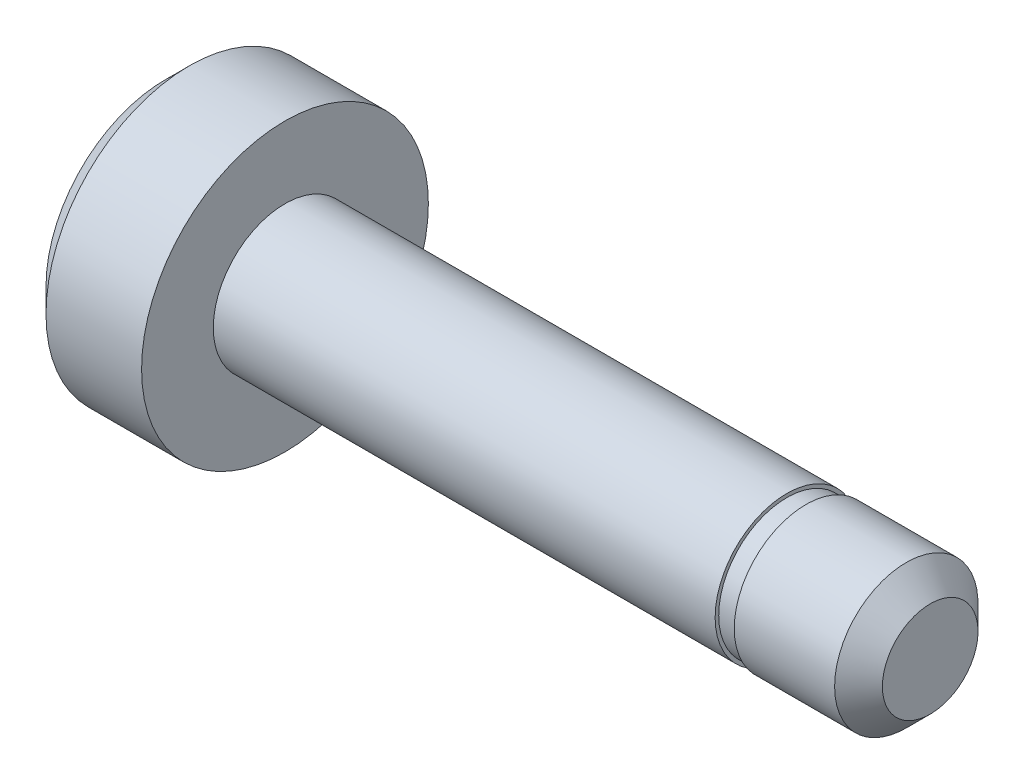
ISO-10303-21;
HEADER;
FILE_DESCRIPTION(('STEP AP214'),'2;1');
FILE_NAME('part.step','',(''),(''),'','','');
FILE_SCHEMA(('AUTOMOTIVE_DESIGN { 1 0 10303 214 1 1 1 1 }'));
ENDSEC;
DATA;
#1=APPLICATION_CONTEXT('core data for automotive mechanical design processes');
#2=APPLICATION_PROTOCOL_DEFINITION('international standard','automotive_design',2000,#1);
#3=PRODUCT_CONTEXT('',#1,'mechanical');
#4=PRODUCT('Part','Part','',(#3));
#5=PRODUCT_RELATED_PRODUCT_CATEGORY('part','',(#4));
#6=PRODUCT_DEFINITION_FORMATION('','',#4);
#7=PRODUCT_DEFINITION_CONTEXT('part definition',#1,'design');
#8=PRODUCT_DEFINITION('design','',#6,#7);
#9=PRODUCT_DEFINITION_SHAPE('','',#8);
#10=(LENGTH_UNIT() NAMED_UNIT(*) SI_UNIT(.MILLI.,.METRE.));
#11=(NAMED_UNIT(*) PLANE_ANGLE_UNIT() SI_UNIT($,.RADIAN.));
#12=(NAMED_UNIT(*) SI_UNIT($,.STERADIAN.) SOLID_ANGLE_UNIT());
#13=UNCERTAINTY_MEASURE_WITH_UNIT(LENGTH_MEASURE(1.E-05),#10,'distance_accuracy_value','');
#14=(GEOMETRIC_REPRESENTATION_CONTEXT(3) GLOBAL_UNCERTAINTY_ASSIGNED_CONTEXT((#13)) GLOBAL_UNIT_ASSIGNED_CONTEXT((#10,
#11,#12)) REPRESENTATION_CONTEXT('',''));
#15=CARTESIAN_POINT('',(0.,0.,0.));
#16=DIRECTION('',(0.,0.,1.));
#17=DIRECTION('',(1.,0.,0.));
#18=AXIS2_PLACEMENT_3D('',#15,#16,#17);
#19=CARTESIAN_POINT('',(-27.0938896189225,0.,0.));
#20=DIRECTION('',(-1.,0.,0.));
#21=DIRECTION('',(0.,0.,1.));
#22=AXIS2_PLACEMENT_3D('',#19,#20,#21);
#23=CYLINDRICAL_SURFACE('',#22,3.);
#24=CARTESIAN_POINT('',(0.,0.,0.));
#25=DIRECTION('',(-1.,0.,0.));
#26=DIRECTION('',(0.,0.,1.));
#27=AXIS2_PLACEMENT_3D('',#24,#25,#26);
#28=CIRCLE('',#27,3.);
#29=CARTESIAN_POINT('',(0.,0.,3.));
#30=VERTEX_POINT('',#29);
#31=EDGE_CURVE('E10',#30,#30,#28,.T.);
#32=ORIENTED_EDGE('',*,*,#31,.F.);
#33=EDGE_LOOP('',(#32));
#34=FACE_BOUND('',#33,.T.);
#35=CARTESIAN_POINT('',(21.,0.,0.));
#36=DIRECTION('',(-1.,0.,0.));
#37=DIRECTION('',(0.,0.,1.));
#38=AXIS2_PLACEMENT_3D('',#35,#36,#37);
#39=CIRCLE('',#38,3.);
#40=CARTESIAN_POINT('',(21.,0.,3.));
#41=VERTEX_POINT('',#40);
#42=EDGE_CURVE('E65',#41,#41,#39,.T.);
#43=ORIENTED_EDGE('',*,*,#42,.T.);
#44=EDGE_LOOP('',(#43));
#45=FACE_BOUND('',#44,.T.);
#46=ADVANCED_FACE('F31',(#34,#45),#23,.T.);
#47=CARTESIAN_POINT('',(0.,3.,0.));
#48=DIRECTION('',(-1.,0.,0.));
#49=DIRECTION('',(0.,0.,1.));
#50=AXIS2_PLACEMENT_3D('',#47,#48,#49);
#51=PLANE('',#50);
#52=CARTESIAN_POINT('',(0.,0.,0.));
#53=DIRECTION('',(-1.,0.,0.));
#54=DIRECTION('',(0.,0.,1.));
#55=AXIS2_PLACEMENT_3D('',#52,#53,#54);
#56=CIRCLE('',#55,6.);
#57=CARTESIAN_POINT('',(0.,0.,6.));
#58=VERTEX_POINT('',#57);
#59=EDGE_CURVE('E37',#58,#58,#56,.T.);
#60=ORIENTED_EDGE('',*,*,#59,.F.);
#61=EDGE_LOOP('',(#60));
#62=FACE_BOUND('',#61,.T.);
#63=ORIENTED_EDGE('',*,*,#31,.T.);
#64=EDGE_LOOP('',(#63));
#65=FACE_BOUND('',#64,.T.);
#66=ADVANCED_FACE('F111',(#62,#65),#51,.F.);
#67=CARTESIAN_POINT('',(-27.0938896189225,0.,0.));
#68=DIRECTION('',(-1.,0.,0.));
#69=DIRECTION('',(0.,0.,1.));
#70=AXIS2_PLACEMENT_3D('',#67,#68,#69);
#71=CYLINDRICAL_SURFACE('',#70,6.);
#72=CARTESIAN_POINT('',(-4.,0.,0.));
#73=DIRECTION('',(-1.,0.,0.));
#74=DIRECTION('',(0.,0.,1.));
#75=AXIS2_PLACEMENT_3D('',#72,#73,#74);
#76=CIRCLE('',#75,6.);
#77=CARTESIAN_POINT('',(-4.,0.,6.));
#78=VERTEX_POINT('',#77);
#79=EDGE_CURVE('E41',#78,#78,#76,.T.);
#80=ORIENTED_EDGE('',*,*,#79,.F.);
#81=EDGE_LOOP('',(#80));
#82=FACE_BOUND('',#81,.T.);
#83=ORIENTED_EDGE('',*,*,#59,.T.);
#84=EDGE_LOOP('',(#83));
#85=FACE_BOUND('',#84,.T.);
#86=ADVANCED_FACE('F116',(#82,#85),#71,.T.);
#87=CARTESIAN_POINT('',(-4.,0.,0.));
#88=DIRECTION('',(1.,0.,0.));
#89=DIRECTION('',(0.,0.,-1.));
#90=AXIS2_PLACEMENT_3D('',#87,#88,#89);
#91=CONICAL_SURFACE('',#90,6.,0.785398163397448);
#92=CARTESIAN_POINT('',(-5.,0.,0.));
#93=DIRECTION('',(-1.,0.,0.));
#94=DIRECTION('',(0.,0.,1.));
#95=AXIS2_PLACEMENT_3D('',#92,#93,#94);
#96=CIRCLE('',#95,5.);
#97=CARTESIAN_POINT('',(-5.,0.,5.));
#98=VERTEX_POINT('',#97);
#99=EDGE_CURVE('E45',#98,#98,#96,.T.);
#100=ORIENTED_EDGE('',*,*,#99,.F.);
#101=EDGE_LOOP('',(#100));
#102=FACE_BOUND('',#101,.T.);
#103=ORIENTED_EDGE('',*,*,#79,.T.);
#104=EDGE_LOOP('',(#103));
#105=FACE_BOUND('',#104,.T.);
#106=ADVANCED_FACE('F107',(#102,#105),#91,.T.);
#107=CARTESIAN_POINT('',(-5.,5.,0.));
#108=DIRECTION('',(1.,0.,0.));
#109=DIRECTION('',(0.,0.,-1.));
#110=AXIS2_PLACEMENT_3D('',#107,#108,#109);
#111=PLANE('',#110);
#112=ORIENTED_EDGE('',*,*,#99,.T.);
#113=EDGE_LOOP('',(#112));
#114=FACE_BOUND('',#113,.T.);
#115=ADVANCED_FACE('F102',(#114),#111,.F.);
#116=CARTESIAN_POINT('',(27.,2.,0.));
#117=DIRECTION('',(-1.,0.,0.));
#118=DIRECTION('',(0.,0.,1.));
#119=AXIS2_PLACEMENT_3D('',#116,#117,#118);
#120=PLANE('',#119);
#121=CARTESIAN_POINT('',(27.,0.,0.));
#122=DIRECTION('',(-1.,0.,0.));
#123=DIRECTION('',(0.,0.,1.));
#124=AXIS2_PLACEMENT_3D('',#121,#122,#123);
#125=CIRCLE('',#124,2.);
#126=CARTESIAN_POINT('',(27.,0.,2.));
#127=VERTEX_POINT('',#126);
#128=EDGE_CURVE('E50',#127,#127,#125,.T.);
#129=ORIENTED_EDGE('',*,*,#128,.F.);
#130=EDGE_LOOP('',(#129));
#131=FACE_BOUND('',#130,.T.);
#132=ADVANCED_FACE('F97',(#131),#120,.F.);
#133=CARTESIAN_POINT('',(27.,0.,0.));
#134=DIRECTION('',(-1.,0.,0.));
#135=DIRECTION('',(0.,0.,1.));
#136=AXIS2_PLACEMENT_3D('',#133,#134,#135);
#137=CONICAL_SURFACE('',#136,2.,0.785398163397448);
#138=CARTESIAN_POINT('',(26.,0.,0.));
#139=DIRECTION('',(-1.,0.,0.));
#140=DIRECTION('',(0.,0.,1.));
#141=AXIS2_PLACEMENT_3D('',#138,#139,#140);
#142=CIRCLE('',#141,3.);
#143=CARTESIAN_POINT('',(26.,0.,3.));
#144=VERTEX_POINT('',#143);
#145=EDGE_CURVE('E53',#144,#144,#142,.T.);
#146=ORIENTED_EDGE('',*,*,#145,.F.);
#147=EDGE_LOOP('',(#146));
#148=FACE_BOUND('',#147,.T.);
#149=ORIENTED_EDGE('',*,*,#128,.T.);
#150=EDGE_LOOP('',(#149));
#151=FACE_BOUND('',#150,.T.);
#152=ADVANCED_FACE('F91',(#148,#151),#137,.T.);
#153=CARTESIAN_POINT('',(-27.0938896189225,0.,0.));
#154=DIRECTION('',(-1.,0.,0.));
#155=DIRECTION('',(0.,0.,1.));
#156=AXIS2_PLACEMENT_3D('',#153,#154,#155);
#157=CYLINDRICAL_SURFACE('',#156,3.);
#158=CARTESIAN_POINT('',(21.8,0.,0.));
#159=DIRECTION('',(-1.,0.,0.));
#160=DIRECTION('',(0.,0.,1.));
#161=AXIS2_PLACEMENT_3D('',#158,#159,#160);
#162=CIRCLE('',#161,3.);
#163=CARTESIAN_POINT('',(21.8,0.,3.));
#164=VERTEX_POINT('',#163);
#165=EDGE_CURVE('E56',#164,#164,#162,.T.);
#166=ORIENTED_EDGE('',*,*,#165,.F.);
#167=EDGE_LOOP('',(#166));
#168=FACE_BOUND('',#167,.T.);
#169=ORIENTED_EDGE('',*,*,#145,.T.);
#170=EDGE_LOOP('',(#169));
#171=FACE_BOUND('',#170,.T.);
#172=ADVANCED_FACE('F85',(#168,#171),#157,.T.);
#173=CARTESIAN_POINT('',(21.8,3.,0.));
#174=DIRECTION('',(1.,0.,0.));
#175=DIRECTION('',(0.,0.,-1.));
#176=AXIS2_PLACEMENT_3D('',#173,#174,#175);
#177=PLANE('',#176);
#178=CARTESIAN_POINT('',(21.8,0.,0.));
#179=DIRECTION('',(-1.,0.,0.));
#180=DIRECTION('',(0.,0.,1.));
#181=AXIS2_PLACEMENT_3D('',#178,#179,#180);
#182=CIRCLE('',#181,2.85);
#183=CARTESIAN_POINT('',(21.8,0.,2.85));
#184=VERTEX_POINT('',#183);
#185=EDGE_CURVE('E59',#184,#184,#182,.T.);
#186=ORIENTED_EDGE('',*,*,#185,.F.);
#187=EDGE_LOOP('',(#186));
#188=FACE_BOUND('',#187,.T.);
#189=ORIENTED_EDGE('',*,*,#165,.T.);
#190=EDGE_LOOP('',(#189));
#191=FACE_BOUND('',#190,.T.);
#192=ADVANCED_FACE('F79',(#188,#191),#177,.F.);
#193=CARTESIAN_POINT('',(-27.0938896189225,0.,0.));
#194=DIRECTION('',(-1.,0.,0.));
#195=DIRECTION('',(0.,0.,1.));
#196=AXIS2_PLACEMENT_3D('',#193,#194,#195);
#197=CYLINDRICAL_SURFACE('',#196,2.85);
#198=CARTESIAN_POINT('',(21.,0.,0.));
#199=DIRECTION('',(-1.,0.,0.));
#200=DIRECTION('',(0.,0.,1.));
#201=AXIS2_PLACEMENT_3D('',#198,#199,#200);
#202=CIRCLE('',#201,2.85);
#203=CARTESIAN_POINT('',(21.,0.,2.85));
#204=VERTEX_POINT('',#203);
#205=EDGE_CURVE('E62',#204,#204,#202,.T.);
#206=ORIENTED_EDGE('',*,*,#205,.F.);
#207=EDGE_LOOP('',(#206));
#208=FACE_BOUND('',#207,.T.);
#209=ORIENTED_EDGE('',*,*,#185,.T.);
#210=EDGE_LOOP('',(#209));
#211=FACE_BOUND('',#210,.T.);
#212=ADVANCED_FACE('F73',(#208,#211),#197,.T.);
#213=CARTESIAN_POINT('',(21.,2.85,0.));
#214=DIRECTION('',(-1.,0.,0.));
#215=DIRECTION('',(0.,0.,1.));
#216=AXIS2_PLACEMENT_3D('',#213,#214,#215);
#217=PLANE('',#216);
#218=ORIENTED_EDGE('',*,*,#42,.F.);
#219=EDGE_LOOP('',(#218));
#220=FACE_BOUND('',#219,.T.);
#221=ORIENTED_EDGE('',*,*,#205,.T.);
#222=EDGE_LOOP('',(#221));
#223=FACE_BOUND('',#222,.T.);
#224=ADVANCED_FACE('F70',(#220,#223),#217,.F.);
#225=CLOSED_SHELL('',(#46,#66,#86,#106,#115,#132,#152,#172,#192,#212,#224));
#226=MANIFOLD_SOLID_BREP('B2',#225);
#227=ADVANCED_BREP_SHAPE_REPRESENTATION('',(#18,#226),#14);
#228=SHAPE_DEFINITION_REPRESENTATION(#9,#227);
ENDSEC;
END-ISO-10303-21;
